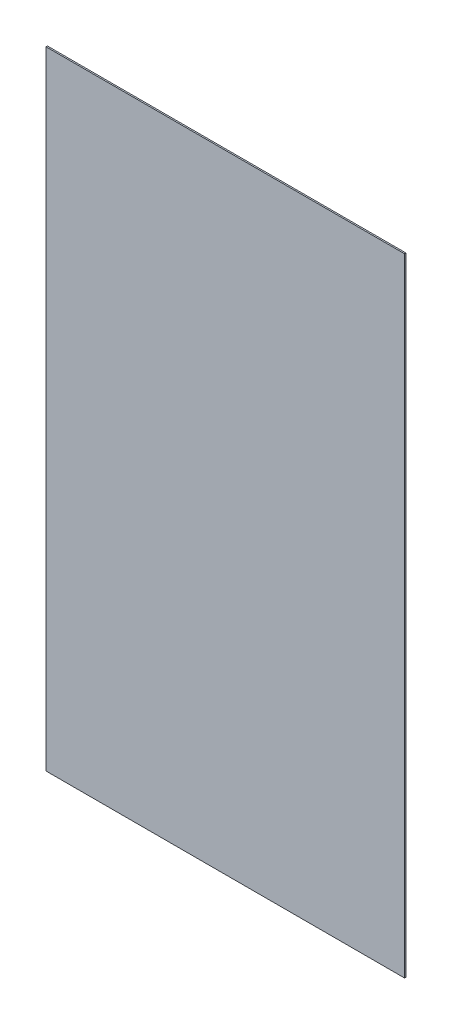
ISO-10303-21;
HEADER;
FILE_DESCRIPTION(('STEP AP214'),'2;1');
FILE_NAME('part.step','',(''),(''),'','','');
FILE_SCHEMA(('AUTOMOTIVE_DESIGN { 1 0 10303 214 1 1 1 1 }'));
ENDSEC;
DATA;
#1=APPLICATION_CONTEXT('core data for automotive mechanical design processes');
#2=APPLICATION_PROTOCOL_DEFINITION('international standard','automotive_design',2000,#1);
#3=PRODUCT_CONTEXT('',#1,'mechanical');
#4=PRODUCT('Part','Part','',(#3));
#5=PRODUCT_RELATED_PRODUCT_CATEGORY('part','',(#4));
#6=PRODUCT_DEFINITION_FORMATION('','',#4);
#7=PRODUCT_DEFINITION_CONTEXT('part definition',#1,'design');
#8=PRODUCT_DEFINITION('design','',#6,#7);
#9=PRODUCT_DEFINITION_SHAPE('','',#8);
#10=(LENGTH_UNIT() NAMED_UNIT(*) SI_UNIT(.MILLI.,.METRE.));
#11=(NAMED_UNIT(*) PLANE_ANGLE_UNIT() SI_UNIT($,.RADIAN.));
#12=(NAMED_UNIT(*) SI_UNIT($,.STERADIAN.) SOLID_ANGLE_UNIT());
#13=UNCERTAINTY_MEASURE_WITH_UNIT(LENGTH_MEASURE(1.E-05),#10,'distance_accuracy_value','');
#14=(GEOMETRIC_REPRESENTATION_CONTEXT(3) GLOBAL_UNCERTAINTY_ASSIGNED_CONTEXT((#13)) GLOBAL_UNIT_ASSIGNED_CONTEXT((#10,
#11,#12)) REPRESENTATION_CONTEXT('',''));
#15=CARTESIAN_POINT('',(0.,0.,0.));
#16=DIRECTION('',(0.,0.,1.));
#17=DIRECTION('',(1.,0.,0.));
#18=AXIS2_PLACEMENT_3D('',#15,#16,#17);
#19=CARTESIAN_POINT('',(0.,-0.634999999999999,0.));
#20=DIRECTION('',(0.,0.,1.));
#21=DIRECTION('',(1.,0.,0.));
#22=AXIS2_PLACEMENT_3D('',#19,#20,#21);
#23=PLANE('',#22);
#24=DIRECTION('',(1.,0.,0.));
#25=VECTOR('',#24,1.);
#26=CARTESIAN_POINT('',(12.7,21.59,0.));
#27=LINE('',#26,#25);
#28=CARTESIAN_POINT('',(12.7,21.59,0.));
#29=VERTEX_POINT('',#28);
#30=CARTESIAN_POINT('',(-12.7,21.59,0.));
#31=VERTEX_POINT('',#30);
#32=EDGE_CURVE('E79',#29,#31,#27,.F.);
#33=ORIENTED_EDGE('',*,*,#32,.F.);
#34=DIRECTION('',(0.,1.,0.));
#35=VECTOR('',#34,1.);
#36=CARTESIAN_POINT('',(12.7,-22.86,0.));
#37=LINE('',#36,#35);
#38=CARTESIAN_POINT('',(12.7,-22.86,0.));
#39=VERTEX_POINT('',#38);
#40=EDGE_CURVE('E55',#39,#29,#37,.T.);
#41=ORIENTED_EDGE('',*,*,#40,.F.);
#42=DIRECTION('',(1.,0.,0.));
#43=VECTOR('',#42,1.);
#44=CARTESIAN_POINT('',(-12.7,-22.86,0.));
#45=LINE('',#44,#43);
#46=CARTESIAN_POINT('',(-12.7,-22.86,0.));
#47=VERTEX_POINT('',#46);
#48=EDGE_CURVE('E57',#47,#39,#45,.T.);
#49=ORIENTED_EDGE('',*,*,#48,.F.);
#50=DIRECTION('',(0.,1.,0.));
#51=VECTOR('',#50,1.);
#52=CARTESIAN_POINT('',(-12.7,21.59,0.));
#53=LINE('',#52,#51);
#54=EDGE_CURVE('E20',#31,#47,#53,.F.);
#55=ORIENTED_EDGE('',*,*,#54,.F.);
#56=EDGE_LOOP('',(#33,#41,#49,#55));
#57=FACE_BOUND('',#56,.T.);
#58=ADVANCED_FACE('F17',(#57),#23,.F.);
#59=CARTESIAN_POINT('',(-12.7,21.59,0.));
#60=DIRECTION('',(-1.,0.,0.));
#61=DIRECTION('',(0.,0.,1.));
#62=AXIS2_PLACEMENT_3D('',#59,#60,#61);
#63=PLANE('',#62);
#64=DIRECTION('',(0.,1.,0.));
#65=VECTOR('',#64,1.);
#66=CARTESIAN_POINT('',(-12.7,-0.634999999999999,0.1));
#67=LINE('',#66,#65);
#68=CARTESIAN_POINT('',(-12.7,21.59,0.1));
#69=VERTEX_POINT('',#68);
#70=CARTESIAN_POINT('',(-12.7,-22.86,0.1));
#71=VERTEX_POINT('',#70);
#72=EDGE_CURVE('E83',#69,#71,#67,.F.);
#73=ORIENTED_EDGE('',*,*,#72,.F.);
#74=DIRECTION('',(0.,0.,1.));
#75=VECTOR('',#74,1.);
#76=CARTESIAN_POINT('',(-12.7,21.59,0.));
#77=LINE('',#76,#75);
#78=EDGE_CURVE('E68',#31,#69,#77,.T.);
#79=ORIENTED_EDGE('',*,*,#78,.F.);
#80=ORIENTED_EDGE('',*,*,#54,.T.);
#81=DIRECTION('',(0.,0.,-1.));
#82=VECTOR('',#81,1.);
#83=CARTESIAN_POINT('',(-12.7,-22.86,0.));
#84=LINE('',#83,#82);
#85=EDGE_CURVE('E63',#71,#47,#84,.T.);
#86=ORIENTED_EDGE('',*,*,#85,.F.);
#87=EDGE_LOOP('',(#73,#79,#80,#86));
#88=FACE_BOUND('',#87,.T.);
#89=ADVANCED_FACE('F65',(#88),#63,.T.);
#90=CARTESIAN_POINT('',(-12.7,-22.86,0.));
#91=DIRECTION('',(0.,-1.,0.));
#92=DIRECTION('',(0.,0.,-1.));
#93=AXIS2_PLACEMENT_3D('',#90,#91,#92);
#94=PLANE('',#93);
#95=DIRECTION('',(1.,0.,0.));
#96=VECTOR('',#95,1.);
#97=CARTESIAN_POINT('',(0.,-22.86,0.1));
#98=LINE('',#97,#96);
#99=CARTESIAN_POINT('',(12.7,-22.86,0.1));
#100=VERTEX_POINT('',#99);
#101=EDGE_CURVE('E72',#71,#100,#98,.T.);
#102=ORIENTED_EDGE('',*,*,#101,.F.);
#103=ORIENTED_EDGE('',*,*,#85,.T.);
#104=ORIENTED_EDGE('',*,*,#48,.T.);
#105=DIRECTION('',(0.,0.,-1.));
#106=VECTOR('',#105,1.);
#107=CARTESIAN_POINT('',(12.7,-22.86,0.));
#108=LINE('',#107,#106);
#109=EDGE_CURVE('E75',#100,#39,#108,.T.);
#110=ORIENTED_EDGE('',*,*,#109,.F.);
#111=EDGE_LOOP('',(#102,#103,#104,#110));
#112=FACE_BOUND('',#111,.T.);
#113=ADVANCED_FACE('F70',(#112),#94,.T.);
#114=CARTESIAN_POINT('',(12.7,-22.86,0.));
#115=DIRECTION('',(1.,0.,0.));
#116=DIRECTION('',(0.,0.,-1.));
#117=AXIS2_PLACEMENT_3D('',#114,#115,#116);
#118=PLANE('',#117);
#119=DIRECTION('',(0.,1.,0.));
#120=VECTOR('',#119,1.);
#121=CARTESIAN_POINT('',(12.7,-0.634999999999999,0.1));
#122=LINE('',#121,#120);
#123=CARTESIAN_POINT('',(12.7,21.59,0.1));
#124=VERTEX_POINT('',#123);
#125=EDGE_CURVE('E26',#100,#124,#122,.T.);
#126=ORIENTED_EDGE('',*,*,#125,.F.);
#127=ORIENTED_EDGE('',*,*,#109,.T.);
#128=ORIENTED_EDGE('',*,*,#40,.T.);
#129=DIRECTION('',(0.,0.,1.));
#130=VECTOR('',#129,1.);
#131=CARTESIAN_POINT('',(12.7,21.59,0.));
#132=LINE('',#131,#130);
#133=EDGE_CURVE('E35',#124,#29,#132,.F.);
#134=ORIENTED_EDGE('',*,*,#133,.F.);
#135=EDGE_LOOP('',(#126,#127,#128,#134));
#136=FACE_BOUND('',#135,.T.);
#137=ADVANCED_FACE('F89',(#136),#118,.T.);
#138=CARTESIAN_POINT('',(12.7,21.59,0.));
#139=DIRECTION('',(0.,1.,0.));
#140=DIRECTION('',(0.,0.,1.));
#141=AXIS2_PLACEMENT_3D('',#138,#139,#140);
#142=PLANE('',#141);
#143=DIRECTION('',(1.,0.,0.));
#144=VECTOR('',#143,1.);
#145=CARTESIAN_POINT('',(0.,21.59,0.1));
#146=LINE('',#145,#144);
#147=EDGE_CURVE('E11',#124,#69,#146,.F.);
#148=ORIENTED_EDGE('',*,*,#147,.F.);
#149=ORIENTED_EDGE('',*,*,#133,.T.);
#150=ORIENTED_EDGE('',*,*,#32,.T.);
#151=ORIENTED_EDGE('',*,*,#78,.T.);
#152=EDGE_LOOP('',(#148,#149,#150,#151));
#153=FACE_BOUND('',#152,.T.);
#154=ADVANCED_FACE('F91',(#153),#142,.T.);
#155=CARTESIAN_POINT('',(0.,-0.634999999999999,0.1));
#156=DIRECTION('',(0.,0.,1.));
#157=DIRECTION('',(1.,0.,0.));
#158=AXIS2_PLACEMENT_3D('',#155,#156,#157);
#159=PLANE('',#158);
#160=ORIENTED_EDGE('',*,*,#125,.T.);
#161=ORIENTED_EDGE('',*,*,#147,.T.);
#162=ORIENTED_EDGE('',*,*,#72,.T.);
#163=ORIENTED_EDGE('',*,*,#101,.T.);
#164=EDGE_LOOP('',(#160,#161,#162,#163));
#165=FACE_BOUND('',#164,.T.);
#166=ADVANCED_FACE('F88',(#165),#159,.T.);
#167=CLOSED_SHELL('',(#58,#89,#113,#137,#154,#166));
#168=MANIFOLD_SOLID_BREP('B1',#167);
#169=ADVANCED_BREP_SHAPE_REPRESENTATION('',(#18,#168),#14);
#170=SHAPE_DEFINITION_REPRESENTATION(#9,#169);
ENDSEC;
END-ISO-10303-21;
